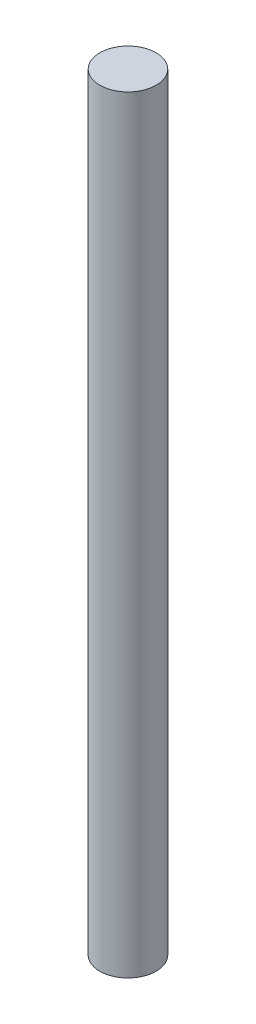
ISO-10303-21;
HEADER;
FILE_DESCRIPTION(('STEP AP214'),'2;1');
FILE_NAME('part.step','',(''),(''),'','','');
FILE_SCHEMA(('AUTOMOTIVE_DESIGN { 1 0 10303 214 1 1 1 1 }'));
ENDSEC;
DATA;
#1=APPLICATION_CONTEXT('core data for automotive mechanical design processes');
#2=APPLICATION_PROTOCOL_DEFINITION('international standard','automotive_design',2000,#1);
#3=PRODUCT_CONTEXT('',#1,'mechanical');
#4=PRODUCT('Part','Part','',(#3));
#5=PRODUCT_RELATED_PRODUCT_CATEGORY('part','',(#4));
#6=PRODUCT_DEFINITION_FORMATION('','',#4);
#7=PRODUCT_DEFINITION_CONTEXT('part definition',#1,'design');
#8=PRODUCT_DEFINITION('design','',#6,#7);
#9=PRODUCT_DEFINITION_SHAPE('','',#8);
#10=(LENGTH_UNIT() NAMED_UNIT(*) SI_UNIT(.MILLI.,.METRE.));
#11=(NAMED_UNIT(*) PLANE_ANGLE_UNIT() SI_UNIT($,.RADIAN.));
#12=(NAMED_UNIT(*) SI_UNIT($,.STERADIAN.) SOLID_ANGLE_UNIT());
#13=UNCERTAINTY_MEASURE_WITH_UNIT(LENGTH_MEASURE(1.E-05),#10,'distance_accuracy_value','');
#14=(GEOMETRIC_REPRESENTATION_CONTEXT(3) GLOBAL_UNCERTAINTY_ASSIGNED_CONTEXT((#13)) GLOBAL_UNIT_ASSIGNED_CONTEXT((#10,
#11,#12)) REPRESENTATION_CONTEXT('',''));
#15=CARTESIAN_POINT('',(0.,0.,0.));
#16=DIRECTION('',(0.,0.,1.));
#17=DIRECTION('',(1.,0.,0.));
#18=AXIS2_PLACEMENT_3D('',#15,#16,#17);
#19=CARTESIAN_POINT('',(0.,86.28,0.));
#20=DIRECTION('',(0.,-1.,0.));
#21=DIRECTION('',(0.,0.,-1.));
#22=AXIS2_PLACEMENT_3D('',#19,#20,#21);
#23=CYLINDRICAL_SURFACE('',#22,3.165);
#24=CARTESIAN_POINT('',(0.,86.28,0.));
#25=DIRECTION('',(0.,1.,0.));
#26=DIRECTION('',(0.,0.,1.));
#27=AXIS2_PLACEMENT_3D('',#24,#25,#26);
#28=CIRCLE('',#27,3.165);
#29=CARTESIAN_POINT('',(0.,86.28,3.165));
#30=VERTEX_POINT('',#29);
#31=EDGE_CURVE('E10',#30,#30,#28,.T.);
#32=ORIENTED_EDGE('',*,*,#31,.F.);
#33=EDGE_LOOP('',(#32));
#34=FACE_BOUND('',#33,.T.);
#35=CARTESIAN_POINT('',(0.,0.,0.));
#36=DIRECTION('',(0.,1.,0.));
#37=DIRECTION('',(0.,0.,1.));
#38=AXIS2_PLACEMENT_3D('',#35,#36,#37);
#39=CIRCLE('',#38,3.165);
#40=CARTESIAN_POINT('',(0.,0.,3.165));
#41=VERTEX_POINT('',#40);
#42=EDGE_CURVE('E34',#41,#41,#39,.T.);
#43=ORIENTED_EDGE('',*,*,#42,.T.);
#44=EDGE_LOOP('',(#43));
#45=FACE_BOUND('',#44,.T.);
#46=ADVANCED_FACE('F31',(#34,#45),#23,.T.);
#47=CARTESIAN_POINT('',(0.,86.28,0.));
#48=DIRECTION('',(0.,1.,0.));
#49=DIRECTION('',(0.,0.,1.));
#50=AXIS2_PLACEMENT_3D('',#47,#48,#49);
#51=PLANE('',#50);
#52=ORIENTED_EDGE('',*,*,#31,.T.);
#53=EDGE_LOOP('',(#52));
#54=FACE_BOUND('',#53,.T.);
#55=ADVANCED_FACE('F46',(#54),#51,.T.);
#56=CARTESIAN_POINT('',(0.,0.,0.));
#57=DIRECTION('',(0.,1.,0.));
#58=DIRECTION('',(0.,0.,1.));
#59=AXIS2_PLACEMENT_3D('',#56,#57,#58);
#60=PLANE('',#59);
#61=ORIENTED_EDGE('',*,*,#42,.F.);
#62=EDGE_LOOP('',(#61));
#63=FACE_BOUND('',#62,.T.);
#64=ADVANCED_FACE('F44',(#63),#60,.F.);
#65=CLOSED_SHELL('',(#46,#55,#64));
#66=MANIFOLD_SOLID_BREP('B2',#65);
#67=ADVANCED_BREP_SHAPE_REPRESENTATION('',(#18,#66),#14);
#68=SHAPE_DEFINITION_REPRESENTATION(#9,#67);
ENDSEC;
END-ISO-10303-21;
